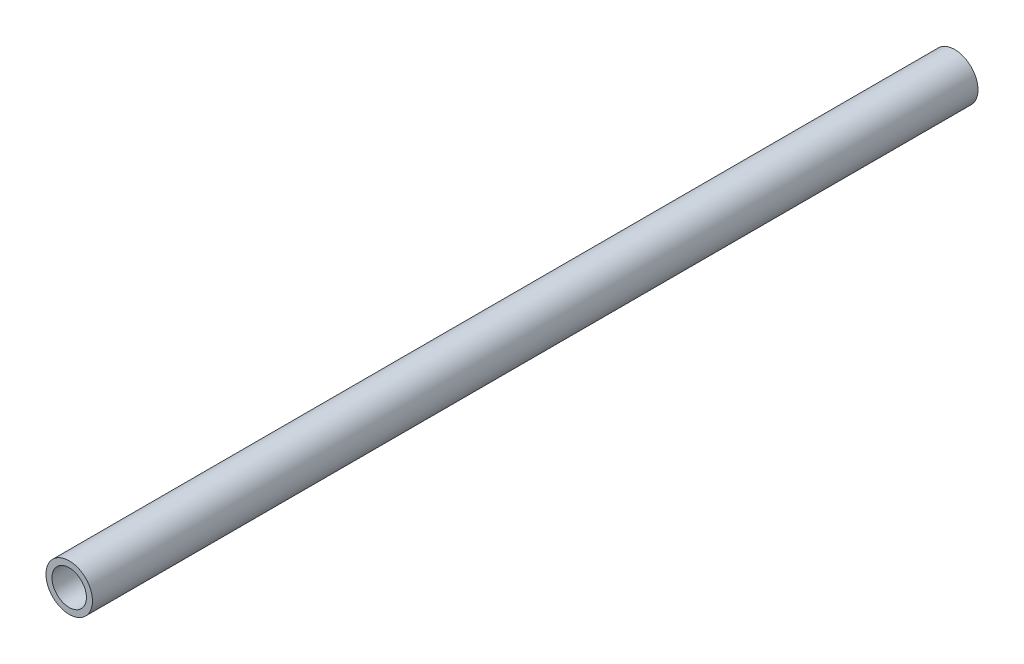
ISO-10303-21;
HEADER;
FILE_DESCRIPTION(('STEP AP214'),'2;1');
FILE_NAME('part.step','',(''),(''),'','','');
FILE_SCHEMA(('AUTOMOTIVE_DESIGN { 1 0 10303 214 1 1 1 1 }'));
ENDSEC;
DATA;
#1=APPLICATION_CONTEXT('core data for automotive mechanical design processes');
#2=APPLICATION_PROTOCOL_DEFINITION('international standard','automotive_design',2000,#1);
#3=PRODUCT_CONTEXT('',#1,'mechanical');
#4=PRODUCT('Part','Part','',(#3));
#5=PRODUCT_RELATED_PRODUCT_CATEGORY('part','',(#4));
#6=PRODUCT_DEFINITION_FORMATION('','',#4);
#7=PRODUCT_DEFINITION_CONTEXT('part definition',#1,'design');
#8=PRODUCT_DEFINITION('design','',#6,#7);
#9=PRODUCT_DEFINITION_SHAPE('','',#8);
#10=(LENGTH_UNIT() NAMED_UNIT(*) SI_UNIT(.MILLI.,.METRE.));
#11=(NAMED_UNIT(*) PLANE_ANGLE_UNIT() SI_UNIT($,.RADIAN.));
#12=(NAMED_UNIT(*) SI_UNIT($,.STERADIAN.) SOLID_ANGLE_UNIT());
#13=UNCERTAINTY_MEASURE_WITH_UNIT(LENGTH_MEASURE(1.E-05),#10,'distance_accuracy_value','');
#14=(GEOMETRIC_REPRESENTATION_CONTEXT(3) GLOBAL_UNCERTAINTY_ASSIGNED_CONTEXT((#13)) GLOBAL_UNIT_ASSIGNED_CONTEXT((#10,
#11,#12)) REPRESENTATION_CONTEXT('',''));
#15=CARTESIAN_POINT('',(0.,0.,0.));
#16=DIRECTION('',(0.,0.,1.));
#17=DIRECTION('',(1.,0.,0.));
#18=AXIS2_PLACEMENT_3D('',#15,#16,#17);
#19=CARTESIAN_POINT('',(0.,0.,203.25));
#20=DIRECTION('',(0.,0.,1.));
#21=DIRECTION('',(1.,0.,0.));
#22=AXIS2_PLACEMENT_3D('',#19,#20,#21);
#23=PLANE('',#22);
#24=CARTESIAN_POINT('',(0.,0.,203.25));
#25=DIRECTION('',(0.,0.,1.));
#26=DIRECTION('',(1.,0.,0.));
#27=AXIS2_PLACEMENT_3D('',#24,#25,#26);
#28=CIRCLE('',#27,10.668);
#29=CARTESIAN_POINT('',(10.668,0.,203.25));
#30=VERTEX_POINT('',#29);
#31=EDGE_CURVE('E11',#30,#30,#28,.T.);
#32=ORIENTED_EDGE('',*,*,#31,.T.);
#33=EDGE_LOOP('',(#32));
#34=FACE_BOUND('',#33,.T.);
#35=CARTESIAN_POINT('',(0.,0.,203.25));
#36=DIRECTION('',(0.,0.,1.));
#37=DIRECTION('',(1.,0.,0.));
#38=AXIS2_PLACEMENT_3D('',#35,#36,#37);
#39=CIRCLE('',#38,7.8994);
#40=CARTESIAN_POINT('',(7.8994,0.,203.25));
#41=VERTEX_POINT('',#40);
#42=EDGE_CURVE('E48',#41,#41,#39,.T.);
#43=ORIENTED_EDGE('',*,*,#42,.F.);
#44=EDGE_LOOP('',(#43));
#45=FACE_BOUND('',#44,.T.);
#46=ADVANCED_FACE('F37',(#34,#45),#23,.T.);
#47=CARTESIAN_POINT('',(0.,0.,-203.25));
#48=DIRECTION('',(0.,0.,1.));
#49=DIRECTION('',(1.,0.,0.));
#50=AXIS2_PLACEMENT_3D('',#47,#48,#49);
#51=PLANE('',#50);
#52=CARTESIAN_POINT('',(0.,0.,-203.25));
#53=DIRECTION('',(0.,0.,1.));
#54=DIRECTION('',(1.,0.,0.));
#55=AXIS2_PLACEMENT_3D('',#52,#53,#54);
#56=CIRCLE('',#55,10.668);
#57=CARTESIAN_POINT('',(10.668,0.,-203.25));
#58=VERTEX_POINT('',#57);
#59=EDGE_CURVE('E41',#58,#58,#56,.T.);
#60=ORIENTED_EDGE('',*,*,#59,.F.);
#61=EDGE_LOOP('',(#60));
#62=FACE_BOUND('',#61,.T.);
#63=CARTESIAN_POINT('',(0.,0.,-203.25));
#64=DIRECTION('',(0.,0.,1.));
#65=DIRECTION('',(1.,0.,0.));
#66=AXIS2_PLACEMENT_3D('',#63,#64,#65);
#67=CIRCLE('',#66,7.8994);
#68=CARTESIAN_POINT('',(7.8994,0.,-203.25));
#69=VERTEX_POINT('',#68);
#70=EDGE_CURVE('E50',#69,#69,#67,.T.);
#71=ORIENTED_EDGE('',*,*,#70,.T.);
#72=EDGE_LOOP('',(#71));
#73=FACE_BOUND('',#72,.T.);
#74=ADVANCED_FACE('F60',(#62,#73),#51,.F.);
#75=CARTESIAN_POINT('',(0.,0.,203.25));
#76=DIRECTION('',(0.,0.,-1.));
#77=DIRECTION('',(-1.,0.,0.));
#78=AXIS2_PLACEMENT_3D('',#75,#76,#77);
#79=CYLINDRICAL_SURFACE('',#78,10.668);
#80=ORIENTED_EDGE('',*,*,#31,.F.);
#81=EDGE_LOOP('',(#80));
#82=FACE_BOUND('',#81,.T.);
#83=ORIENTED_EDGE('',*,*,#59,.T.);
#84=EDGE_LOOP('',(#83));
#85=FACE_BOUND('',#84,.T.);
#86=ADVANCED_FACE('F39',(#82,#85),#79,.T.);
#87=CARTESIAN_POINT('',(0.,0.,203.25));
#88=DIRECTION('',(0.,0.,-1.));
#89=DIRECTION('',(-1.,0.,0.));
#90=AXIS2_PLACEMENT_3D('',#87,#88,#89);
#91=CYLINDRICAL_SURFACE('',#90,7.8994);
#92=ORIENTED_EDGE('',*,*,#42,.T.);
#93=EDGE_LOOP('',(#92));
#94=FACE_BOUND('',#93,.T.);
#95=ORIENTED_EDGE('',*,*,#70,.F.);
#96=EDGE_LOOP('',(#95));
#97=FACE_BOUND('',#96,.T.);
#98=ADVANCED_FACE('F56',(#94,#97),#91,.F.);
#99=CLOSED_SHELL('',(#46,#74,#86,#98));
#100=MANIFOLD_SOLID_BREP('B2',#99);
#101=ADVANCED_BREP_SHAPE_REPRESENTATION('',(#18,#100),#14);
#102=SHAPE_DEFINITION_REPRESENTATION(#9,#101);
ENDSEC;
END-ISO-10303-21;
